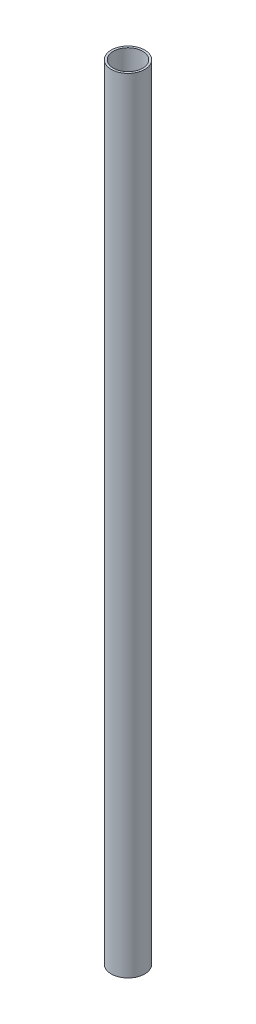
ISO-10303-21;
HEADER;
FILE_DESCRIPTION(('STEP AP214'),'2;1');
FILE_NAME('part.step','',(''),(''),'','','');
FILE_SCHEMA(('AUTOMOTIVE_DESIGN { 1 0 10303 214 1 1 1 1 }'));
ENDSEC;
DATA;
#1=APPLICATION_CONTEXT('core data for automotive mechanical design processes');
#2=APPLICATION_PROTOCOL_DEFINITION('international standard','automotive_design',2000,#1);
#3=PRODUCT_CONTEXT('',#1,'mechanical');
#4=PRODUCT('Part','Part','',(#3));
#5=PRODUCT_RELATED_PRODUCT_CATEGORY('part','',(#4));
#6=PRODUCT_DEFINITION_FORMATION('','',#4);
#7=PRODUCT_DEFINITION_CONTEXT('part definition',#1,'design');
#8=PRODUCT_DEFINITION('design','',#6,#7);
#9=PRODUCT_DEFINITION_SHAPE('','',#8);
#10=(LENGTH_UNIT() NAMED_UNIT(*) SI_UNIT(.MILLI.,.METRE.));
#11=(NAMED_UNIT(*) PLANE_ANGLE_UNIT() SI_UNIT($,.RADIAN.));
#12=(NAMED_UNIT(*) SI_UNIT($,.STERADIAN.) SOLID_ANGLE_UNIT());
#13=UNCERTAINTY_MEASURE_WITH_UNIT(LENGTH_MEASURE(1.E-05),#10,'distance_accuracy_value','');
#14=(GEOMETRIC_REPRESENTATION_CONTEXT(3) GLOBAL_UNCERTAINTY_ASSIGNED_CONTEXT((#13)) GLOBAL_UNIT_ASSIGNED_CONTEXT((#10,
#11,#12)) REPRESENTATION_CONTEXT('',''));
#15=CARTESIAN_POINT('',(0.,0.,0.));
#16=DIRECTION('',(0.,0.,1.));
#17=DIRECTION('',(1.,0.,0.));
#18=AXIS2_PLACEMENT_3D('',#15,#16,#17);
#19=CARTESIAN_POINT('',(0.,280.,0.));
#20=DIRECTION('',(0.,1.,0.));
#21=DIRECTION('',(0.,0.,1.));
#22=AXIS2_PLACEMENT_3D('',#19,#20,#21);
#23=PLANE('',#22);
#24=CARTESIAN_POINT('',(0.,280.,0.));
#25=DIRECTION('',(0.,1.,0.));
#26=DIRECTION('',(0.,0.,1.));
#27=AXIS2_PLACEMENT_3D('',#24,#25,#26);
#28=CIRCLE('',#27,6.);
#29=CARTESIAN_POINT('',(0.,280.,6.));
#30=VERTEX_POINT('',#29);
#31=EDGE_CURVE('E10',#30,#30,#28,.T.);
#32=ORIENTED_EDGE('',*,*,#31,.T.);
#33=EDGE_LOOP('',(#32));
#34=FACE_BOUND('',#33,.T.);
#35=CARTESIAN_POINT('',(0.,280.,0.));
#36=DIRECTION('',(0.,1.,0.));
#37=DIRECTION('',(0.,0.,1.));
#38=AXIS2_PLACEMENT_3D('',#35,#36,#37);
#39=CIRCLE('',#38,5.25);
#40=CARTESIAN_POINT('',(0.,280.,5.25));
#41=VERTEX_POINT('',#40);
#42=EDGE_CURVE('E43',#41,#41,#39,.T.);
#43=ORIENTED_EDGE('',*,*,#42,.F.);
#44=EDGE_LOOP('',(#43));
#45=FACE_BOUND('',#44,.T.);
#46=ADVANCED_FACE('F32',(#34,#45),#23,.T.);
#47=CARTESIAN_POINT('',(0.,0.,0.));
#48=DIRECTION('',(0.,1.,0.));
#49=DIRECTION('',(0.,0.,1.));
#50=AXIS2_PLACEMENT_3D('',#47,#48,#49);
#51=PLANE('',#50);
#52=CARTESIAN_POINT('',(0.,0.,0.));
#53=DIRECTION('',(0.,1.,0.));
#54=DIRECTION('',(0.,0.,1.));
#55=AXIS2_PLACEMENT_3D('',#52,#53,#54);
#56=CIRCLE('',#55,6.);
#57=CARTESIAN_POINT('',(0.,0.,6.));
#58=VERTEX_POINT('',#57);
#59=EDGE_CURVE('E36',#58,#58,#56,.T.);
#60=ORIENTED_EDGE('',*,*,#59,.F.);
#61=EDGE_LOOP('',(#60));
#62=FACE_BOUND('',#61,.T.);
#63=CARTESIAN_POINT('',(0.,0.,0.));
#64=DIRECTION('',(0.,1.,0.));
#65=DIRECTION('',(0.,0.,1.));
#66=AXIS2_PLACEMENT_3D('',#63,#64,#65);
#67=CIRCLE('',#66,5.25);
#68=CARTESIAN_POINT('',(0.,0.,5.25));
#69=VERTEX_POINT('',#68);
#70=EDGE_CURVE('E45',#69,#69,#67,.T.);
#71=ORIENTED_EDGE('',*,*,#70,.T.);
#72=EDGE_LOOP('',(#71));
#73=FACE_BOUND('',#72,.T.);
#74=ADVANCED_FACE('F55',(#62,#73),#51,.F.);
#75=CARTESIAN_POINT('',(0.,280.,0.));
#76=DIRECTION('',(0.,-1.,0.));
#77=DIRECTION('',(0.,0.,-1.));
#78=AXIS2_PLACEMENT_3D('',#75,#76,#77);
#79=CYLINDRICAL_SURFACE('',#78,6.);
#80=ORIENTED_EDGE('',*,*,#31,.F.);
#81=EDGE_LOOP('',(#80));
#82=FACE_BOUND('',#81,.T.);
#83=ORIENTED_EDGE('',*,*,#59,.T.);
#84=EDGE_LOOP('',(#83));
#85=FACE_BOUND('',#84,.T.);
#86=ADVANCED_FACE('F34',(#82,#85),#79,.T.);
#87=CARTESIAN_POINT('',(0.,280.,0.));
#88=DIRECTION('',(0.,-1.,0.));
#89=DIRECTION('',(0.,0.,-1.));
#90=AXIS2_PLACEMENT_3D('',#87,#88,#89);
#91=CYLINDRICAL_SURFACE('',#90,5.25);
#92=ORIENTED_EDGE('',*,*,#42,.T.);
#93=EDGE_LOOP('',(#92));
#94=FACE_BOUND('',#93,.T.);
#95=ORIENTED_EDGE('',*,*,#70,.F.);
#96=EDGE_LOOP('',(#95));
#97=FACE_BOUND('',#96,.T.);
#98=ADVANCED_FACE('F51',(#94,#97),#91,.F.);
#99=CLOSED_SHELL('',(#46,#74,#86,#98));
#100=MANIFOLD_SOLID_BREP('B2',#99);
#101=ADVANCED_BREP_SHAPE_REPRESENTATION('',(#18,#100),#14);
#102=SHAPE_DEFINITION_REPRESENTATION(#9,#101);
ENDSEC;
END-ISO-10303-21;
